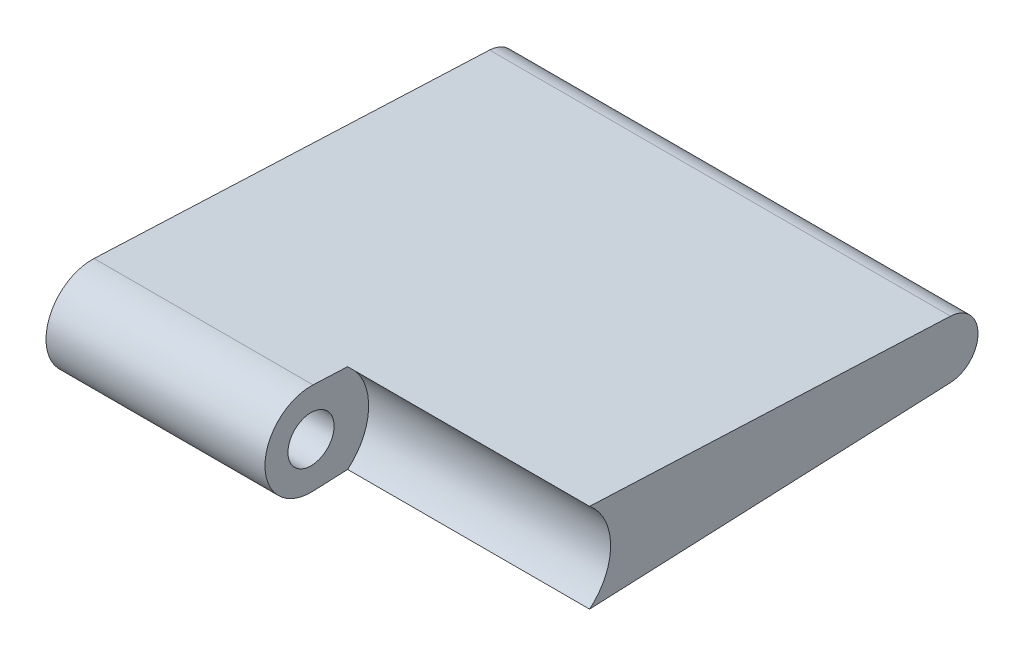
ISO-10303-21;
HEADER;
FILE_DESCRIPTION(('STEP AP214'),'2;1');
FILE_NAME('part.step','',(''),(''),'','','');
FILE_SCHEMA(('AUTOMOTIVE_DESIGN { 1 0 10303 214 1 1 1 1 }'));
ENDSEC;
DATA;
#1=APPLICATION_CONTEXT('core data for automotive mechanical design processes');
#2=APPLICATION_PROTOCOL_DEFINITION('international standard','automotive_design',2000,#1);
#3=PRODUCT_CONTEXT('',#1,'mechanical');
#4=PRODUCT('Part','Part','',(#3));
#5=PRODUCT_RELATED_PRODUCT_CATEGORY('part','',(#4));
#6=PRODUCT_DEFINITION_FORMATION('','',#4);
#7=PRODUCT_DEFINITION_CONTEXT('part definition',#1,'design');
#8=PRODUCT_DEFINITION('design','',#6,#7);
#9=PRODUCT_DEFINITION_SHAPE('','',#8);
#10=(LENGTH_UNIT() NAMED_UNIT(*) SI_UNIT(.MILLI.,.METRE.));
#11=(NAMED_UNIT(*) PLANE_ANGLE_UNIT() SI_UNIT($,.RADIAN.));
#12=(NAMED_UNIT(*) SI_UNIT($,.STERADIAN.) SOLID_ANGLE_UNIT());
#13=UNCERTAINTY_MEASURE_WITH_UNIT(LENGTH_MEASURE(1.E-05),#10,'distance_accuracy_value','');
#14=(GEOMETRIC_REPRESENTATION_CONTEXT(3) GLOBAL_UNCERTAINTY_ASSIGNED_CONTEXT((#13)) GLOBAL_UNIT_ASSIGNED_CONTEXT((#10,
#11,#12)) REPRESENTATION_CONTEXT('',''));
#15=CARTESIAN_POINT('',(0.,0.,0.));
#16=DIRECTION('',(0.,0.,1.));
#17=DIRECTION('',(1.,0.,0.));
#18=AXIS2_PLACEMENT_3D('',#15,#16,#17);
#19=CARTESIAN_POINT('',(-15.68196,0.,6.4150855365158));
#20=DIRECTION('',(1.,0.,0.));
#21=DIRECTION('',(0.,0.,-1.));
#22=AXIS2_PLACEMENT_3D('',#19,#20,#21);
#23=CYLINDRICAL_SURFACE('',#22,1.56718);
#24=DIRECTION('',(1.,0.,0.));
#25=VECTOR('',#24,1.);
#26=CARTESIAN_POINT('',(-15.68196,-1.56569523817573,6.34688309115031));
#27=LINE('',#26,#25);
#28=CARTESIAN_POINT('',(-15.68196,-1.56569523817573,6.34688309115031));
#29=VERTEX_POINT('',#28);
#30=CARTESIAN_POINT('',(-8.23214,-1.56569523817573,6.34688309115031));
#31=VERTEX_POINT('',#30);
#32=EDGE_CURVE('E78',#29,#31,#27,.T.);
#33=ORIENTED_EDGE('',*,*,#32,.T.);
#34=CARTESIAN_POINT('',(-8.23214,0.,6.4150855365158));
#35=DIRECTION('',(1.,0.,0.));
#36=DIRECTION('',(0.,0.,-1.));
#37=AXIS2_PLACEMENT_3D('',#34,#35,#36);
#38=CIRCLE('',#37,1.56718);
#39=CARTESIAN_POINT('',(-8.23214,1.56569523817573,6.34688309115031));
#40=VERTEX_POINT('',#39);
#41=EDGE_CURVE('E218',#31,#40,#38,.F.);
#42=ORIENTED_EDGE('',*,*,#41,.T.);
#43=DIRECTION('',(1.,0.,0.));
#44=VECTOR('',#43,1.);
#45=CARTESIAN_POINT('',(-15.68196,1.56569523817573,6.34688309115031));
#46=LINE('',#45,#44);
#47=CARTESIAN_POINT('',(-15.68196,1.56569523817573,6.34688309115031));
#48=VERTEX_POINT('',#47);
#49=EDGE_CURVE('E11',#48,#40,#46,.T.);
#50=ORIENTED_EDGE('',*,*,#49,.F.);
#51=CARTESIAN_POINT('',(-15.68196,0.,6.4150855365158));
#52=DIRECTION('',(1.,0.,0.));
#53=DIRECTION('',(0.,0.,-1.));
#54=AXIS2_PLACEMENT_3D('',#51,#52,#53);
#55=CIRCLE('',#54,1.56718);
#56=EDGE_CURVE('E114',#48,#29,#55,.T.);
#57=ORIENTED_EDGE('',*,*,#56,.T.);
#58=EDGE_LOOP('',(#33,#42,#50,#57));
#59=FACE_BOUND('',#58,.T.);
#60=ADVANCED_FACE('F32',(#59),#23,.T.);
#61=CARTESIAN_POINT('',(-15.68196,0.,6.4150855365158));
#62=DIRECTION('',(1.,0.,0.));
#63=DIRECTION('',(0.,0.,-1.));
#64=AXIS2_PLACEMENT_3D('',#61,#62,#63);
#65=CYLINDRICAL_SURFACE('',#64,0.78486);
#66=CARTESIAN_POINT('',(-15.68196,0.,6.4150855365158));
#67=DIRECTION('',(1.,0.,0.));
#68=DIRECTION('',(0.,0.,-1.));
#69=AXIS2_PLACEMENT_3D('',#66,#67,#68);
#70=CIRCLE('',#69,0.78486);
#71=CARTESIAN_POINT('',(-15.68196,0.,5.6302255365158));
#72=VERTEX_POINT('',#71);
#73=EDGE_CURVE('E110',#72,#72,#70,.T.);
#74=ORIENTED_EDGE('',*,*,#73,.F.);
#75=EDGE_LOOP('',(#74));
#76=FACE_BOUND('',#75,.T.);
#77=CARTESIAN_POINT('',(-8.23214,0.,6.4150855365158));
#78=DIRECTION('',(1.,0.,0.));
#79=DIRECTION('',(0.,0.,-1.));
#80=AXIS2_PLACEMENT_3D('',#77,#78,#79);
#81=CIRCLE('',#80,0.78486);
#82=CARTESIAN_POINT('',(-8.23214,0.,5.6302255365158));
#83=VERTEX_POINT('',#82);
#84=EDGE_CURVE('E35',#83,#83,#81,.F.);
#85=ORIENTED_EDGE('',*,*,#84,.F.);
#86=EDGE_LOOP('',(#85));
#87=FACE_BOUND('',#86,.T.);
#88=ADVANCED_FACE('F142',(#76,#87),#65,.F.);
#89=CARTESIAN_POINT('',(-15.68196,1.56569523817573,6.34688309115031));
#90=DIRECTION('',(0.,0.999052590114559,-0.0435192162773174));
#91=DIRECTION('',(0.,0.0435192162773174,0.999052590114559));
#92=AXIS2_PLACEMENT_3D('',#89,#90,#91);
#93=PLANE('',#92);
#94=DIRECTION('',(1.,0.,0.));
#95=VECTOR('',#94,1.);
#96=CARTESIAN_POINT('',(-8.23214,1.51440534975517,5.16944240502391));
#97=LINE('',#96,#95);
#98=CARTESIAN_POINT('',(0.,1.51440534975517,5.16944240502391));
#99=VERTEX_POINT('',#98);
#100=CARTESIAN_POINT('',(-8.23214,1.51440534975517,5.16944240502391));
#101=VERTEX_POINT('',#100);
#102=EDGE_CURVE('E97',#99,#101,#97,.F.);
#103=ORIENTED_EDGE('',*,*,#102,.F.);
#104=DIRECTION('',(0.,0.0435192162773174,0.999052590114559));
#105=VECTOR('',#104,1.);
#106=CARTESIAN_POINT('',(0.,1.56569523817573,6.34688309115031));
#107=LINE('',#106,#105);
#108=CARTESIAN_POINT('',(0.,0.979511121451916,-7.10990244389114));
#109=VERTEX_POINT('',#108);
#110=EDGE_CURVE('E108',#109,#99,#107,.T.);
#111=ORIENTED_EDGE('',*,*,#110,.F.);
#112=DIRECTION('',(1.,0.,0.));
#113=VECTOR('',#112,1.);
#114=CARTESIAN_POINT('',(-15.68196,0.979511121451916,-7.10990244389114));
#115=LINE('',#114,#113);
#116=CARTESIAN_POINT('',(-15.68196,0.979511121451916,-7.10990244389114));
#117=VERTEX_POINT('',#116);
#118=EDGE_CURVE('E40',#117,#109,#115,.T.);
#119=ORIENTED_EDGE('',*,*,#118,.F.);
#120=DIRECTION('',(0.,0.0435192162773174,0.999052590114559));
#121=VECTOR('',#120,1.);
#122=CARTESIAN_POINT('',(-15.68196,1.56569523817573,6.34688309115031));
#123=LINE('',#122,#121);
#124=EDGE_CURVE('E125',#117,#48,#123,.T.);
#125=ORIENTED_EDGE('',*,*,#124,.T.);
#126=ORIENTED_EDGE('',*,*,#49,.T.);
#127=DIRECTION('',(0.,-0.0435192162773174,-0.999052590114559));
#128=VECTOR('',#127,1.);
#129=CARTESIAN_POINT('',(-8.23214,1.56569523817573,6.34688309115031));
#130=LINE('',#129,#128);
#131=EDGE_CURVE('E109',#40,#101,#130,.T.);
#132=ORIENTED_EDGE('',*,*,#131,.T.);
#133=EDGE_LOOP('',(#103,#111,#119,#125,#126,#132));
#134=FACE_BOUND('',#133,.T.);
#135=ADVANCED_FACE('F107',(#134),#93,.T.);
#136=CARTESIAN_POINT('',(-15.68196,0.,-7.0672344634842));
#137=DIRECTION('',(1.,0.,0.));
#138=DIRECTION('',(0.,0.,-1.));
#139=AXIS2_PLACEMENT_3D('',#136,#137,#138);
#140=CYLINDRICAL_SURFACE('',#139,0.980439999999998);
#141=CARTESIAN_POINT('',(0.,0.,-7.0672344634842));
#142=DIRECTION('',(1.,0.,0.));
#143=DIRECTION('',(0.,0.,-1.));
#144=AXIS2_PLACEMENT_3D('',#141,#142,#143);
#145=CIRCLE('',#144,0.980439999999998);
#146=CARTESIAN_POINT('',(0.,-0.979511121451916,-7.10990244389114));
#147=VERTEX_POINT('',#146);
#148=EDGE_CURVE('E113',#147,#109,#145,.T.);
#149=ORIENTED_EDGE('',*,*,#148,.F.);
#150=DIRECTION('',(1.,0.,0.));
#151=VECTOR('',#150,1.);
#152=CARTESIAN_POINT('',(-15.68196,-0.979511121451916,-7.10990244389114));
#153=LINE('',#152,#151);
#154=CARTESIAN_POINT('',(-15.68196,-0.979511121451916,-7.10990244389114));
#155=VERTEX_POINT('',#154);
#156=EDGE_CURVE('E123',#155,#147,#153,.T.);
#157=ORIENTED_EDGE('',*,*,#156,.F.);
#158=CARTESIAN_POINT('',(-15.68196,0.,-7.0672344634842));
#159=DIRECTION('',(1.,0.,0.));
#160=DIRECTION('',(0.,0.,-1.));
#161=AXIS2_PLACEMENT_3D('',#158,#159,#160);
#162=CIRCLE('',#161,0.980439999999998);
#163=EDGE_CURVE('E127',#155,#117,#162,.T.);
#164=ORIENTED_EDGE('',*,*,#163,.T.);
#165=ORIENTED_EDGE('',*,*,#118,.T.);
#166=EDGE_LOOP('',(#149,#157,#164,#165));
#167=FACE_BOUND('',#166,.T.);
#168=ADVANCED_FACE('F151',(#167),#140,.T.);
#169=CARTESIAN_POINT('',(-15.68196,-1.56569523817573,6.34688309115031));
#170=DIRECTION('',(0.,-0.999052590114559,-0.0435192162773174));
#171=DIRECTION('',(0.,0.0435192162773174,-0.999052590114559));
#172=AXIS2_PLACEMENT_3D('',#169,#170,#171);
#173=PLANE('',#172);
#174=DIRECTION('',(1.,0.,0.));
#175=VECTOR('',#174,1.);
#176=CARTESIAN_POINT('',(-8.23214,-1.51440534975517,5.16944240502391));
#177=LINE('',#176,#175);
#178=CARTESIAN_POINT('',(-8.23214,-1.51440534975517,5.16944240502391));
#179=VERTEX_POINT('',#178);
#180=CARTESIAN_POINT('',(0.,-1.51440534975517,5.16944240502391));
#181=VERTEX_POINT('',#180);
#182=EDGE_CURVE('E48',#179,#181,#177,.T.);
#183=ORIENTED_EDGE('',*,*,#182,.F.);
#184=DIRECTION('',(0.,-0.0435192162773174,0.999052590114559));
#185=VECTOR('',#184,1.);
#186=CARTESIAN_POINT('',(-8.23214,-1.56569523817573,6.34688309115031));
#187=LINE('',#186,#185);
#188=EDGE_CURVE('E221',#179,#31,#187,.T.);
#189=ORIENTED_EDGE('',*,*,#188,.T.);
#190=ORIENTED_EDGE('',*,*,#32,.F.);
#191=DIRECTION('',(0.,0.0435192162773174,-0.999052590114559));
#192=VECTOR('',#191,1.);
#193=CARTESIAN_POINT('',(-15.68196,-1.56569523817573,6.34688309115031));
#194=LINE('',#193,#192);
#195=EDGE_CURVE('E116',#29,#155,#194,.T.);
#196=ORIENTED_EDGE('',*,*,#195,.T.);
#197=ORIENTED_EDGE('',*,*,#156,.T.);
#198=DIRECTION('',(0.,0.0435192162773174,-0.999052590114559));
#199=VECTOR('',#198,1.);
#200=CARTESIAN_POINT('',(0.,-1.56569523817573,6.34688309115031));
#201=LINE('',#200,#199);
#202=EDGE_CURVE('E118',#181,#147,#201,.T.);
#203=ORIENTED_EDGE('',*,*,#202,.F.);
#204=EDGE_LOOP('',(#183,#189,#190,#196,#197,#203));
#205=FACE_BOUND('',#204,.T.);
#206=ADVANCED_FACE('F137',(#205),#173,.T.);
#207=CARTESIAN_POINT('',(-15.68196,0.,6.4150855365158));
#208=DIRECTION('',(1.,0.,0.));
#209=DIRECTION('',(0.,0.,-1.));
#210=AXIS2_PLACEMENT_3D('',#207,#208,#209);
#211=PLANE('',#210);
#212=ORIENTED_EDGE('',*,*,#73,.T.);
#213=EDGE_LOOP('',(#212));
#214=FACE_BOUND('',#213,.T.);
#215=ORIENTED_EDGE('',*,*,#56,.F.);
#216=ORIENTED_EDGE('',*,*,#124,.F.);
#217=ORIENTED_EDGE('',*,*,#163,.F.);
#218=ORIENTED_EDGE('',*,*,#195,.F.);
#219=EDGE_LOOP('',(#215,#216,#217,#218));
#220=FACE_BOUND('',#219,.T.);
#221=ADVANCED_FACE('F140',(#214,#220),#211,.F.);
#222=CARTESIAN_POINT('',(0.,0.,6.4150855365158));
#223=DIRECTION('',(1.,0.,0.));
#224=DIRECTION('',(0.,0.,-1.));
#225=AXIS2_PLACEMENT_3D('',#222,#223,#224);
#226=PLANE('',#225);
#227=CARTESIAN_POINT('',(0.,0.,6.4150855365158));
#228=DIRECTION('',(1.,0.,0.));
#229=DIRECTION('',(0.,0.,-1.));
#230=AXIS2_PLACEMENT_3D('',#227,#228,#229);
#231=CIRCLE('',#230,1.96088);
#232=EDGE_CURVE('E94',#181,#99,#231,.T.);
#233=ORIENTED_EDGE('',*,*,#232,.F.);
#234=ORIENTED_EDGE('',*,*,#202,.T.);
#235=ORIENTED_EDGE('',*,*,#148,.T.);
#236=ORIENTED_EDGE('',*,*,#110,.T.);
#237=EDGE_LOOP('',(#233,#234,#235,#236));
#238=FACE_BOUND('',#237,.T.);
#239=ADVANCED_FACE('F112',(#238),#226,.T.);
#240=CARTESIAN_POINT('',(-8.23214,0.,6.4150855365158));
#241=DIRECTION('',(1.,0.,0.));
#242=DIRECTION('',(0.,0.,-1.));
#243=AXIS2_PLACEMENT_3D('',#240,#241,#242);
#244=PLANE('',#243);
#245=ORIENTED_EDGE('',*,*,#41,.F.);
#246=ORIENTED_EDGE('',*,*,#188,.F.);
#247=CARTESIAN_POINT('',(-8.23214,0.,6.4150855365158));
#248=DIRECTION('',(1.,0.,0.));
#249=DIRECTION('',(0.,0.,-1.));
#250=AXIS2_PLACEMENT_3D('',#247,#248,#249);
#251=CIRCLE('',#250,1.96088);
#252=EDGE_CURVE('E102',#179,#101,#251,.T.);
#253=ORIENTED_EDGE('',*,*,#252,.T.);
#254=ORIENTED_EDGE('',*,*,#131,.F.);
#255=EDGE_LOOP('',(#245,#246,#253,#254));
#256=FACE_BOUND('',#255,.T.);
#257=ORIENTED_EDGE('',*,*,#84,.T.);
#258=EDGE_LOOP('',(#257));
#259=FACE_BOUND('',#258,.T.);
#260=ADVANCED_FACE('F160',(#256,#259),#244,.T.);
#261=CARTESIAN_POINT('',(-8.23214,0.,6.4150855365158));
#262=DIRECTION('',(1.,0.,0.));
#263=DIRECTION('',(0.,0.,-1.));
#264=AXIS2_PLACEMENT_3D('',#261,#262,#263);
#265=CYLINDRICAL_SURFACE('',#264,1.96088);
#266=ORIENTED_EDGE('',*,*,#102,.T.);
#267=ORIENTED_EDGE('',*,*,#252,.F.);
#268=ORIENTED_EDGE('',*,*,#182,.T.);
#269=ORIENTED_EDGE('',*,*,#232,.T.);
#270=EDGE_LOOP('',(#266,#267,#268,#269));
#271=FACE_BOUND('',#270,.T.);
#272=ADVANCED_FACE('F96',(#271),#265,.F.);
#273=CLOSED_SHELL('',(#60,#88,#135,#168,#206,#221,#239,#260,#272));
#274=MANIFOLD_SOLID_BREP('B2',#273);
#275=ADVANCED_BREP_SHAPE_REPRESENTATION('',(#18,#274),#14);
#276=SHAPE_DEFINITION_REPRESENTATION(#9,#275);
ENDSEC;
END-ISO-10303-21;
